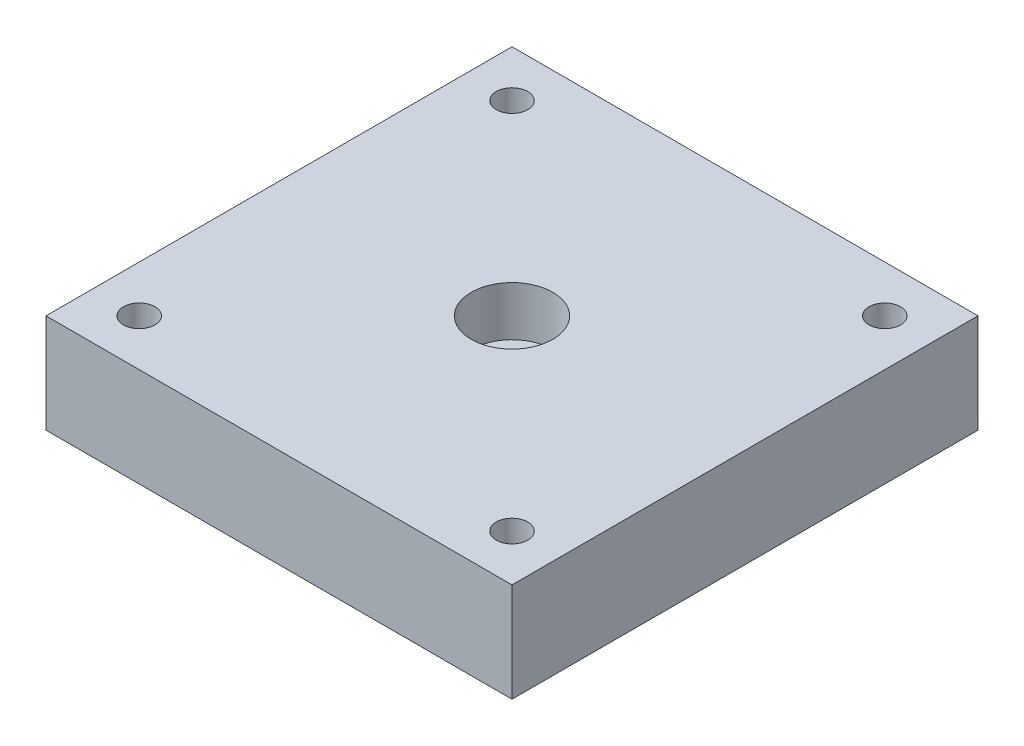
ISO-10303-21;
HEADER;
FILE_DESCRIPTION(('STEP AP214'),'2;1');
FILE_NAME('part.step','',(''),(''),'','','');
FILE_SCHEMA(('AUTOMOTIVE_DESIGN { 1 0 10303 214 1 1 1 1 }'));
ENDSEC;
DATA;
#1=APPLICATION_CONTEXT('core data for automotive mechanical design processes');
#2=APPLICATION_PROTOCOL_DEFINITION('international standard','automotive_design',2000,#1);
#3=PRODUCT_CONTEXT('',#1,'mechanical');
#4=PRODUCT('Part','Part','',(#3));
#5=PRODUCT_RELATED_PRODUCT_CATEGORY('part','',(#4));
#6=PRODUCT_DEFINITION_FORMATION('','',#4);
#7=PRODUCT_DEFINITION_CONTEXT('part definition',#1,'design');
#8=PRODUCT_DEFINITION('design','',#6,#7);
#9=PRODUCT_DEFINITION_SHAPE('','',#8);
#10=(LENGTH_UNIT() NAMED_UNIT(*) SI_UNIT(.MILLI.,.METRE.));
#11=(NAMED_UNIT(*) PLANE_ANGLE_UNIT() SI_UNIT($,.RADIAN.));
#12=(NAMED_UNIT(*) SI_UNIT($,.STERADIAN.) SOLID_ANGLE_UNIT());
#13=UNCERTAINTY_MEASURE_WITH_UNIT(LENGTH_MEASURE(1.E-05),#10,'distance_accuracy_value','');
#14=(GEOMETRIC_REPRESENTATION_CONTEXT(3) GLOBAL_UNCERTAINTY_ASSIGNED_CONTEXT((#13)) GLOBAL_UNIT_ASSIGNED_CONTEXT((#10,
#11,#12)) REPRESENTATION_CONTEXT('',''));
#15=CARTESIAN_POINT('',(0.,0.,0.));
#16=DIRECTION('',(0.,0.,1.));
#17=DIRECTION('',(1.,0.,0.));
#18=AXIS2_PLACEMENT_3D('',#15,#16,#17);
#19=CARTESIAN_POINT('',(20.,0.,-20.));
#20=DIRECTION('',(0.,1.,0.));
#21=DIRECTION('',(0.,0.,1.));
#22=AXIS2_PLACEMENT_3D('',#19,#20,#21);
#23=CYLINDRICAL_SURFACE('',#22,2.1);
#24=CARTESIAN_POINT('',(20.,0.,-20.));
#25=DIRECTION('',(0.,1.,0.));
#26=DIRECTION('',(0.,0.,1.));
#27=AXIS2_PLACEMENT_3D('',#24,#25,#26);
#28=CIRCLE('',#27,2.1);
#29=CARTESIAN_POINT('',(20.,0.,-17.9));
#30=VERTEX_POINT('',#29);
#31=EDGE_CURVE('E132',#30,#30,#28,.T.);
#32=ORIENTED_EDGE('',*,*,#31,.F.);
#33=EDGE_LOOP('',(#32));
#34=FACE_BOUND('',#33,.T.);
#35=CARTESIAN_POINT('',(20.,4.25,-20.));
#36=DIRECTION('',(0.,1.,0.));
#37=DIRECTION('',(0.,0.,1.));
#38=AXIS2_PLACEMENT_3D('',#35,#36,#37);
#39=CIRCLE('',#38,2.1);
#40=CARTESIAN_POINT('',(20.,4.25,-17.9));
#41=VERTEX_POINT('',#40);
#42=EDGE_CURVE('E53',#41,#41,#39,.F.);
#43=ORIENTED_EDGE('',*,*,#42,.F.);
#44=EDGE_LOOP('',(#43));
#45=FACE_BOUND('',#44,.T.);
#46=ADVANCED_FACE('F49',(#34,#45),#23,.F.);
#47=CARTESIAN_POINT('',(0.,8.5,0.));
#48=DIRECTION('',(1.,0.,0.));
#49=DIRECTION('',(0.,0.,-1.));
#50=AXIS2_PLACEMENT_3D('',#47,#48,#49);
#51=PLANE('',#50);
#52=DIRECTION('',(0.,0.,1.));
#53=VECTOR('',#52,1.);
#54=CARTESIAN_POINT('',(0.,0.,0.));
#55=LINE('',#54,#53);
#56=CARTESIAN_POINT('',(0.,0.,-40.));
#57=VERTEX_POINT('',#56);
#58=CARTESIAN_POINT('',(0.,0.,0.));
#59=VERTEX_POINT('',#58);
#60=EDGE_CURVE('E115',#57,#59,#55,.T.);
#61=ORIENTED_EDGE('',*,*,#60,.T.);
#62=DIRECTION('',(0.,-1.,0.));
#63=VECTOR('',#62,1.);
#64=CARTESIAN_POINT('',(0.,8.5,0.));
#65=LINE('',#64,#63);
#66=CARTESIAN_POINT('',(0.,8.5,0.));
#67=VERTEX_POINT('',#66);
#68=EDGE_CURVE('E13',#67,#59,#65,.T.);
#69=ORIENTED_EDGE('',*,*,#68,.F.);
#70=DIRECTION('',(0.,0.,1.));
#71=VECTOR('',#70,1.);
#72=CARTESIAN_POINT('',(0.,8.5,0.));
#73=LINE('',#72,#71);
#74=CARTESIAN_POINT('',(0.,8.5,-40.));
#75=VERTEX_POINT('',#74);
#76=EDGE_CURVE('E102',#75,#67,#73,.T.);
#77=ORIENTED_EDGE('',*,*,#76,.F.);
#78=DIRECTION('',(0.,-1.,0.));
#79=VECTOR('',#78,1.);
#80=CARTESIAN_POINT('',(0.,8.5,-40.));
#81=LINE('',#80,#79);
#82=EDGE_CURVE('E111',#75,#57,#81,.T.);
#83=ORIENTED_EDGE('',*,*,#82,.T.);
#84=EDGE_LOOP('',(#61,#69,#77,#83));
#85=FACE_BOUND('',#84,.T.);
#86=ADVANCED_FACE('F51',(#85),#51,.F.);
#87=CARTESIAN_POINT('',(0.,8.5,0.));
#88=DIRECTION('',(0.,0.,-1.));
#89=DIRECTION('',(-1.,0.,0.));
#90=AXIS2_PLACEMENT_3D('',#87,#88,#89);
#91=PLANE('',#90);
#92=DIRECTION('',(1.,0.,0.));
#93=VECTOR('',#92,1.);
#94=CARTESIAN_POINT('',(0.,0.,0.));
#95=LINE('',#94,#93);
#96=CARTESIAN_POINT('',(40.,0.,0.));
#97=VERTEX_POINT('',#96);
#98=EDGE_CURVE('E106',#59,#97,#95,.T.);
#99=ORIENTED_EDGE('',*,*,#98,.T.);
#100=DIRECTION('',(0.,-1.,0.));
#101=VECTOR('',#100,1.);
#102=CARTESIAN_POINT('',(40.,8.5,0.));
#103=LINE('',#102,#101);
#104=CARTESIAN_POINT('',(40.,8.5,0.));
#105=VERTEX_POINT('',#104);
#106=EDGE_CURVE('E59',#105,#97,#103,.T.);
#107=ORIENTED_EDGE('',*,*,#106,.F.);
#108=DIRECTION('',(1.,0.,0.));
#109=VECTOR('',#108,1.);
#110=CARTESIAN_POINT('',(0.,8.5,0.));
#111=LINE('',#110,#109);
#112=EDGE_CURVE('E97',#67,#105,#111,.T.);
#113=ORIENTED_EDGE('',*,*,#112,.F.);
#114=ORIENTED_EDGE('',*,*,#68,.T.);
#115=EDGE_LOOP('',(#99,#107,#113,#114));
#116=FACE_BOUND('',#115,.T.);
#117=ADVANCED_FACE('F105',(#116),#91,.F.);
#118=CARTESIAN_POINT('',(40.,8.5,0.));
#119=DIRECTION('',(-1.,0.,0.));
#120=DIRECTION('',(0.,0.,1.));
#121=AXIS2_PLACEMENT_3D('',#118,#119,#120);
#122=PLANE('',#121);
#123=DIRECTION('',(0.,0.,-1.));
#124=VECTOR('',#123,1.);
#125=CARTESIAN_POINT('',(40.,0.,0.));
#126=LINE('',#125,#124);
#127=CARTESIAN_POINT('',(40.,0.,-40.));
#128=VERTEX_POINT('',#127);
#129=EDGE_CURVE('E84',#97,#128,#126,.T.);
#130=ORIENTED_EDGE('',*,*,#129,.T.);
#131=DIRECTION('',(0.,-1.,0.));
#132=VECTOR('',#131,1.);
#133=CARTESIAN_POINT('',(40.,8.5,-40.));
#134=LINE('',#133,#132);
#135=CARTESIAN_POINT('',(40.,8.5,-40.));
#136=VERTEX_POINT('',#135);
#137=EDGE_CURVE('E107',#136,#128,#134,.T.);
#138=ORIENTED_EDGE('',*,*,#137,.F.);
#139=DIRECTION('',(0.,0.,-1.));
#140=VECTOR('',#139,1.);
#141=CARTESIAN_POINT('',(40.,8.5,0.));
#142=LINE('',#141,#140);
#143=EDGE_CURVE('E100',#105,#136,#142,.T.);
#144=ORIENTED_EDGE('',*,*,#143,.F.);
#145=ORIENTED_EDGE('',*,*,#106,.T.);
#146=EDGE_LOOP('',(#130,#138,#144,#145));
#147=FACE_BOUND('',#146,.T.);
#148=ADVANCED_FACE('F109',(#147),#122,.F.);
#149=CARTESIAN_POINT('',(0.,8.5,-40.));
#150=DIRECTION('',(0.,0.,1.));
#151=DIRECTION('',(1.,0.,0.));
#152=AXIS2_PLACEMENT_3D('',#149,#150,#151);
#153=PLANE('',#152);
#154=DIRECTION('',(-1.,0.,0.));
#155=VECTOR('',#154,1.);
#156=CARTESIAN_POINT('',(0.,0.,-40.));
#157=LINE('',#156,#155);
#158=EDGE_CURVE('E90',#128,#57,#157,.T.);
#159=ORIENTED_EDGE('',*,*,#158,.T.);
#160=ORIENTED_EDGE('',*,*,#82,.F.);
#161=DIRECTION('',(-1.,0.,0.));
#162=VECTOR('',#161,1.);
#163=CARTESIAN_POINT('',(0.,8.5,-40.));
#164=LINE('',#163,#162);
#165=EDGE_CURVE('E67',#136,#75,#164,.T.);
#166=ORIENTED_EDGE('',*,*,#165,.F.);
#167=ORIENTED_EDGE('',*,*,#137,.T.);
#168=EDGE_LOOP('',(#159,#160,#166,#167));
#169=FACE_BOUND('',#168,.T.);
#170=ADVANCED_FACE('F123',(#169),#153,.F.);
#171=CARTESIAN_POINT('',(0.,8.5,0.));
#172=DIRECTION('',(0.,-1.,0.));
#173=DIRECTION('',(0.,0.,-1.));
#174=AXIS2_PLACEMENT_3D('',#171,#172,#173);
#175=PLANE('',#174);
#176=CARTESIAN_POINT('',(20.,8.5,-20.));
#177=DIRECTION('',(0.,1.,0.));
#178=DIRECTION('',(0.,0.,1.));
#179=AXIS2_PLACEMENT_3D('',#176,#177,#178);
#180=CIRCLE('',#179,3.5);
#181=CARTESIAN_POINT('',(20.,8.5,-16.5));
#182=VERTEX_POINT('',#181);
#183=EDGE_CURVE('E155',#182,#182,#180,.T.);
#184=ORIENTED_EDGE('',*,*,#183,.F.);
#185=EDGE_LOOP('',(#184));
#186=FACE_BOUND('',#185,.T.);
#187=CARTESIAN_POINT('',(3.99999999999989,8.5,-36.));
#188=DIRECTION('',(0.,1.,0.));
#189=DIRECTION('',(0.,0.,1.));
#190=AXIS2_PLACEMENT_3D('',#187,#188,#189);
#191=CIRCLE('',#190,1.3525);
#192=CARTESIAN_POINT('',(3.99999999999989,8.5,-34.6475));
#193=VERTEX_POINT('',#192);
#194=EDGE_CURVE('E135',#193,#193,#191,.T.);
#195=ORIENTED_EDGE('',*,*,#194,.F.);
#196=EDGE_LOOP('',(#195));
#197=FACE_BOUND('',#196,.T.);
#198=CARTESIAN_POINT('',(35.9999999999999,8.5,-36.));
#199=DIRECTION('',(0.,1.,0.));
#200=DIRECTION('',(0.,0.,1.));
#201=AXIS2_PLACEMENT_3D('',#198,#199,#200);
#202=CIRCLE('',#201,1.35249999999999);
#203=CARTESIAN_POINT('',(35.9999999999999,8.5,-34.6475));
#204=VERTEX_POINT('',#203);
#205=EDGE_CURVE('E141',#204,#204,#202,.T.);
#206=ORIENTED_EDGE('',*,*,#205,.F.);
#207=EDGE_LOOP('',(#206));
#208=FACE_BOUND('',#207,.T.);
#209=CARTESIAN_POINT('',(36.,8.5,-4.));
#210=DIRECTION('',(0.,1.,0.));
#211=DIRECTION('',(0.,0.,1.));
#212=AXIS2_PLACEMENT_3D('',#209,#210,#211);
#213=CIRCLE('',#212,1.35249999999999);
#214=CARTESIAN_POINT('',(36.,8.5,-2.6475));
#215=VERTEX_POINT('',#214);
#216=EDGE_CURVE('E147',#215,#215,#213,.T.);
#217=ORIENTED_EDGE('',*,*,#216,.F.);
#218=EDGE_LOOP('',(#217));
#219=FACE_BOUND('',#218,.T.);
#220=CARTESIAN_POINT('',(4.,8.5,-4.));
#221=DIRECTION('',(0.,1.,0.));
#222=DIRECTION('',(0.,0.,1.));
#223=AXIS2_PLACEMENT_3D('',#220,#221,#222);
#224=CIRCLE('',#223,1.3525);
#225=CARTESIAN_POINT('',(4.,8.5,-2.6475));
#226=VERTEX_POINT('',#225);
#227=EDGE_CURVE('E129',#226,#226,#224,.T.);
#228=ORIENTED_EDGE('',*,*,#227,.F.);
#229=EDGE_LOOP('',(#228));
#230=FACE_BOUND('',#229,.T.);
#231=ORIENTED_EDGE('',*,*,#76,.T.);
#232=ORIENTED_EDGE('',*,*,#112,.T.);
#233=ORIENTED_EDGE('',*,*,#143,.T.);
#234=ORIENTED_EDGE('',*,*,#165,.T.);
#235=EDGE_LOOP('',(#231,#232,#233,#234));
#236=FACE_BOUND('',#235,.T.);
#237=ADVANCED_FACE('F98',(#186,#197,#208,#219,#230,#236),#175,.F.);
#238=CARTESIAN_POINT('',(0.,0.,0.));
#239=DIRECTION('',(0.,-1.,0.));
#240=DIRECTION('',(0.,0.,-1.));
#241=AXIS2_PLACEMENT_3D('',#238,#239,#240);
#242=PLANE('',#241);
#243=CARTESIAN_POINT('',(3.99999999999989,0.,-36.));
#244=DIRECTION('',(0.,1.,0.));
#245=DIRECTION('',(0.,0.,1.));
#246=AXIS2_PLACEMENT_3D('',#243,#244,#245);
#247=CIRCLE('',#246,1.3525);
#248=CARTESIAN_POINT('',(3.99999999999989,0.,-34.6475));
#249=VERTEX_POINT('',#248);
#250=EDGE_CURVE('E138',#249,#249,#247,.T.);
#251=ORIENTED_EDGE('',*,*,#250,.T.);
#252=EDGE_LOOP('',(#251));
#253=FACE_BOUND('',#252,.T.);
#254=CARTESIAN_POINT('',(35.9999999999999,0.,-36.));
#255=DIRECTION('',(0.,1.,0.));
#256=DIRECTION('',(0.,0.,1.));
#257=AXIS2_PLACEMENT_3D('',#254,#255,#256);
#258=CIRCLE('',#257,1.35249999999999);
#259=CARTESIAN_POINT('',(35.9999999999999,0.,-34.6475));
#260=VERTEX_POINT('',#259);
#261=EDGE_CURVE('E144',#260,#260,#258,.T.);
#262=ORIENTED_EDGE('',*,*,#261,.T.);
#263=EDGE_LOOP('',(#262));
#264=FACE_BOUND('',#263,.T.);
#265=CARTESIAN_POINT('',(36.,0.,-4.));
#266=DIRECTION('',(0.,1.,0.));
#267=DIRECTION('',(0.,0.,1.));
#268=AXIS2_PLACEMENT_3D('',#265,#266,#267);
#269=CIRCLE('',#268,1.35249999999999);
#270=CARTESIAN_POINT('',(36.,0.,-2.6475));
#271=VERTEX_POINT('',#270);
#272=EDGE_CURVE('E150',#271,#271,#269,.T.);
#273=ORIENTED_EDGE('',*,*,#272,.T.);
#274=EDGE_LOOP('',(#273));
#275=FACE_BOUND('',#274,.T.);
#276=ORIENTED_EDGE('',*,*,#31,.T.);
#277=EDGE_LOOP('',(#276));
#278=FACE_BOUND('',#277,.T.);
#279=CARTESIAN_POINT('',(4.,0.,-4.));
#280=DIRECTION('',(0.,1.,0.));
#281=DIRECTION('',(0.,0.,1.));
#282=AXIS2_PLACEMENT_3D('',#279,#280,#281);
#283=CIRCLE('',#282,1.3525);
#284=CARTESIAN_POINT('',(4.,0.,-2.6475));
#285=VERTEX_POINT('',#284);
#286=EDGE_CURVE('E118',#285,#285,#283,.T.);
#287=ORIENTED_EDGE('',*,*,#286,.T.);
#288=EDGE_LOOP('',(#287));
#289=FACE_BOUND('',#288,.T.);
#290=ORIENTED_EDGE('',*,*,#60,.F.);
#291=ORIENTED_EDGE('',*,*,#158,.F.);
#292=ORIENTED_EDGE('',*,*,#129,.F.);
#293=ORIENTED_EDGE('',*,*,#98,.F.);
#294=EDGE_LOOP('',(#290,#291,#292,#293));
#295=FACE_BOUND('',#294,.T.);
#296=ADVANCED_FACE('F126',(#253,#264,#275,#278,#289,#295),#242,.T.);
#297=CARTESIAN_POINT('',(4.,0.,-4.));
#298=DIRECTION('',(0.,1.,0.));
#299=DIRECTION('',(0.,0.,1.));
#300=AXIS2_PLACEMENT_3D('',#297,#298,#299);
#301=CYLINDRICAL_SURFACE('',#300,1.3525);
#302=ORIENTED_EDGE('',*,*,#286,.F.);
#303=EDGE_LOOP('',(#302));
#304=FACE_BOUND('',#303,.T.);
#305=ORIENTED_EDGE('',*,*,#227,.T.);
#306=EDGE_LOOP('',(#305));
#307=FACE_BOUND('',#306,.T.);
#308=ADVANCED_FACE('F182',(#304,#307),#301,.F.);
#309=CARTESIAN_POINT('',(36.,0.,-4.));
#310=DIRECTION('',(0.,1.,0.));
#311=DIRECTION('',(0.,0.,1.));
#312=AXIS2_PLACEMENT_3D('',#309,#310,#311);
#313=CYLINDRICAL_SURFACE('',#312,1.35249999999999);
#314=ORIENTED_EDGE('',*,*,#272,.F.);
#315=EDGE_LOOP('',(#314));
#316=FACE_BOUND('',#315,.T.);
#317=ORIENTED_EDGE('',*,*,#216,.T.);
#318=EDGE_LOOP('',(#317));
#319=FACE_BOUND('',#318,.T.);
#320=ADVANCED_FACE('F178',(#316,#319),#313,.F.);
#321=CARTESIAN_POINT('',(35.9999999999999,0.,-36.));
#322=DIRECTION('',(0.,1.,0.));
#323=DIRECTION('',(0.,0.,1.));
#324=AXIS2_PLACEMENT_3D('',#321,#322,#323);
#325=CYLINDRICAL_SURFACE('',#324,1.35249999999999);
#326=ORIENTED_EDGE('',*,*,#261,.F.);
#327=EDGE_LOOP('',(#326));
#328=FACE_BOUND('',#327,.T.);
#329=ORIENTED_EDGE('',*,*,#205,.T.);
#330=EDGE_LOOP('',(#329));
#331=FACE_BOUND('',#330,.T.);
#332=ADVANCED_FACE('F181',(#328,#331),#325,.F.);
#333=CARTESIAN_POINT('',(3.99999999999989,0.,-36.));
#334=DIRECTION('',(0.,1.,0.));
#335=DIRECTION('',(0.,0.,1.));
#336=AXIS2_PLACEMENT_3D('',#333,#334,#335);
#337=CYLINDRICAL_SURFACE('',#336,1.3525);
#338=ORIENTED_EDGE('',*,*,#250,.F.);
#339=EDGE_LOOP('',(#338));
#340=FACE_BOUND('',#339,.T.);
#341=ORIENTED_EDGE('',*,*,#194,.T.);
#342=EDGE_LOOP('',(#341));
#343=FACE_BOUND('',#342,.T.);
#344=ADVANCED_FACE('F186',(#340,#343),#337,.F.);
#345=CARTESIAN_POINT('',(20.,4.25,-20.));
#346=DIRECTION('',(0.,1.,0.));
#347=DIRECTION('',(0.,0.,1.));
#348=AXIS2_PLACEMENT_3D('',#345,#346,#347);
#349=PLANE('',#348);
#350=CARTESIAN_POINT('',(20.,4.25,-20.));
#351=DIRECTION('',(0.,1.,0.));
#352=DIRECTION('',(0.,0.,1.));
#353=AXIS2_PLACEMENT_3D('',#350,#351,#352);
#354=CIRCLE('',#353,3.5);
#355=CARTESIAN_POINT('',(20.,4.25,-16.5));
#356=VERTEX_POINT('',#355);
#357=EDGE_CURVE('E158',#356,#356,#354,.T.);
#358=ORIENTED_EDGE('',*,*,#357,.T.);
#359=EDGE_LOOP('',(#358));
#360=FACE_BOUND('',#359,.T.);
#361=ORIENTED_EDGE('',*,*,#42,.T.);
#362=EDGE_LOOP('',(#361));
#363=FACE_BOUND('',#362,.T.);
#364=ADVANCED_FACE('F165',(#360,#363),#349,.T.);
#365=CARTESIAN_POINT('',(20.,4.25,-20.));
#366=DIRECTION('',(0.,1.,0.));
#367=DIRECTION('',(0.,0.,1.));
#368=AXIS2_PLACEMENT_3D('',#365,#366,#367);
#369=CYLINDRICAL_SURFACE('',#368,3.5);
#370=ORIENTED_EDGE('',*,*,#357,.F.);
#371=EDGE_LOOP('',(#370));
#372=FACE_BOUND('',#371,.T.);
#373=ORIENTED_EDGE('',*,*,#183,.T.);
#374=EDGE_LOOP('',(#373));
#375=FACE_BOUND('',#374,.T.);
#376=ADVANCED_FACE('F176',(#372,#375),#369,.F.);
#377=CLOSED_SHELL('',(#46,#86,#117,#148,#170,#237,#296,#308,#320,#332,#344,#364,#376));
#378=MANIFOLD_SOLID_BREP('B2',#377);
#379=ADVANCED_BREP_SHAPE_REPRESENTATION('',(#18,#378),#14);
#380=SHAPE_DEFINITION_REPRESENTATION(#9,#379);
ENDSEC;
END-ISO-10303-21;
